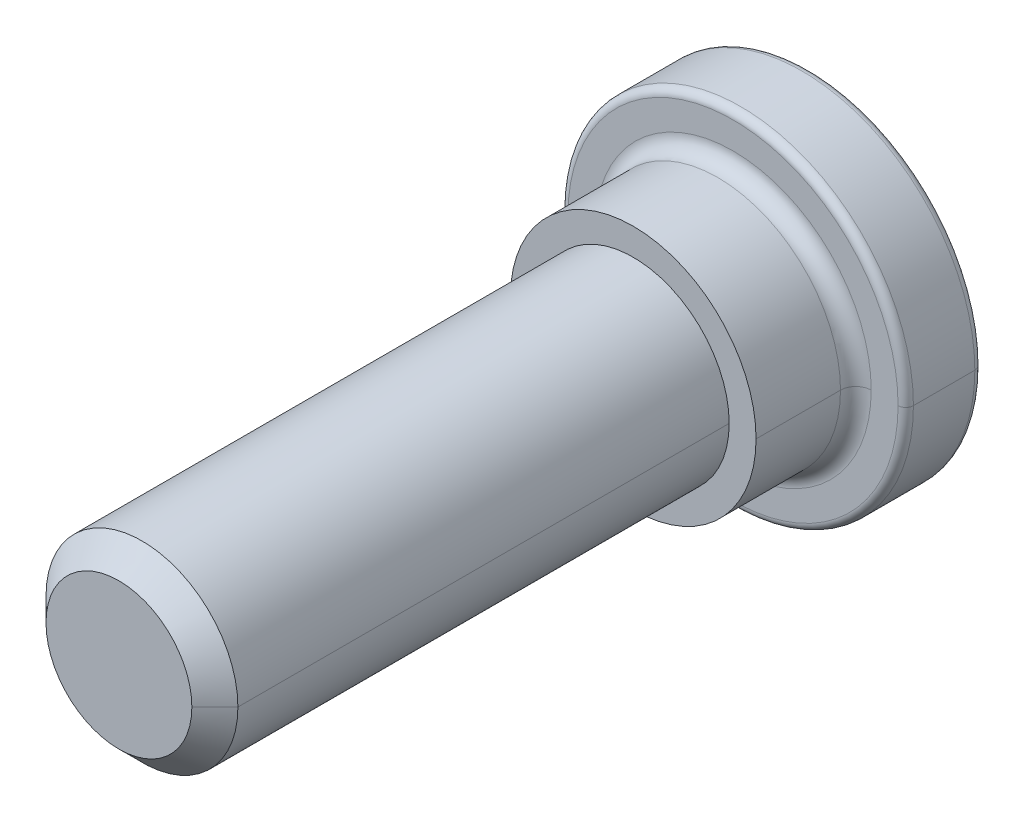
ISO-10303-21;
HEADER;
FILE_DESCRIPTION(('STEP AP214'),'2;1');
FILE_NAME('part.step','',(''),(''),'','','');
FILE_SCHEMA(('AUTOMOTIVE_DESIGN { 1 0 10303 214 1 1 1 1 }'));
ENDSEC;
DATA;
#1=APPLICATION_CONTEXT('core data for automotive mechanical design processes');
#2=APPLICATION_PROTOCOL_DEFINITION('international standard','automotive_design',2000,#1);
#3=PRODUCT_CONTEXT('',#1,'mechanical');
#4=PRODUCT('Part','Part','',(#3));
#5=PRODUCT_RELATED_PRODUCT_CATEGORY('part','',(#4));
#6=PRODUCT_DEFINITION_FORMATION('','',#4);
#7=PRODUCT_DEFINITION_CONTEXT('part definition',#1,'design');
#8=PRODUCT_DEFINITION('design','',#6,#7);
#9=PRODUCT_DEFINITION_SHAPE('','',#8);
#10=(LENGTH_UNIT() NAMED_UNIT(*) SI_UNIT(.MILLI.,.METRE.));
#11=(NAMED_UNIT(*) PLANE_ANGLE_UNIT() SI_UNIT($,.RADIAN.));
#12=(NAMED_UNIT(*) SI_UNIT($,.STERADIAN.) SOLID_ANGLE_UNIT());
#13=UNCERTAINTY_MEASURE_WITH_UNIT(LENGTH_MEASURE(1.E-05),#10,'distance_accuracy_value','');
#14=(GEOMETRIC_REPRESENTATION_CONTEXT(3) GLOBAL_UNCERTAINTY_ASSIGNED_CONTEXT((#13)) GLOBAL_UNIT_ASSIGNED_CONTEXT((#10,
#11,#12)) REPRESENTATION_CONTEXT('',''));
#15=CARTESIAN_POINT('',(0.,0.,0.));
#16=DIRECTION('',(0.,0.,1.));
#17=DIRECTION('',(1.,0.,0.));
#18=AXIS2_PLACEMENT_3D('',#15,#16,#17);
#19=CARTESIAN_POINT('',(0.,0.,1.2));
#20=DIRECTION('',(0.,0.,1.));
#21=DIRECTION('',(1.,0.,0.));
#22=AXIS2_PLACEMENT_3D('',#19,#20,#21);
#23=TOROIDAL_SURFACE('',#22,1.8,0.2);
#24=CARTESIAN_POINT('',(0.,0.,1.2));
#25=DIRECTION('',(0.,0.,1.));
#26=DIRECTION('',(1.,0.,0.));
#27=AXIS2_PLACEMENT_3D('',#24,#25,#26);
#28=CIRCLE('',#27,1.6);
#29=CARTESIAN_POINT('',(1.6,0.,1.2));
#30=VERTEX_POINT('',#29);
#31=CARTESIAN_POINT('',(-1.6,0.,1.2));
#32=VERTEX_POINT('',#31);
#33=EDGE_CURVE('E273',#30,#32,#28,.T.);
#34=ORIENTED_EDGE('',*,*,#33,.F.);
#35=CARTESIAN_POINT('',(1.8,0.,1.2));
#36=DIRECTION('',(0.,-1.,0.));
#37=DIRECTION('',(-1.,0.,0.));
#38=AXIS2_PLACEMENT_3D('',#35,#36,#37);
#39=CIRCLE('',#38,0.2);
#40=CARTESIAN_POINT('',(1.8,0.,1.));
#41=VERTEX_POINT('',#40);
#42=EDGE_CURVE('E212',#30,#41,#39,.T.);
#43=ORIENTED_EDGE('',*,*,#42,.T.);
#44=CARTESIAN_POINT('',(0.,0.,1.));
#45=DIRECTION('',(0.,0.,1.));
#46=DIRECTION('',(1.,0.,0.));
#47=AXIS2_PLACEMENT_3D('',#44,#45,#46);
#48=CIRCLE('',#47,1.8);
#49=CARTESIAN_POINT('',(-1.8,0.,1.));
#50=VERTEX_POINT('',#49);
#51=EDGE_CURVE('E197',#41,#50,#48,.T.);
#52=ORIENTED_EDGE('',*,*,#51,.T.);
#53=CARTESIAN_POINT('',(-1.8,0.,1.2));
#54=DIRECTION('',(0.,1.,0.));
#55=DIRECTION('',(1.,0.,0.));
#56=AXIS2_PLACEMENT_3D('',#53,#54,#55);
#57=CIRCLE('',#56,0.2);
#58=EDGE_CURVE('E186',#32,#50,#57,.T.);
#59=ORIENTED_EDGE('',*,*,#58,.F.);
#60=EDGE_LOOP('',(#34,#43,#52,#59));
#61=FACE_BOUND('',#60,.T.);
#62=ADVANCED_FACE('F16',(#61),#23,.F.);
#63=CARTESIAN_POINT('',(0.,0.,8.85));
#64=DIRECTION('',(0.,0.,-1.));
#65=DIRECTION('',(-1.,0.,0.));
#66=AXIS2_PLACEMENT_3D('',#63,#64,#65);
#67=CONICAL_SURFACE('',#66,1.1,0.7853981633973);
#68=CARTESIAN_POINT('',(0.,0.,9.));
#69=DIRECTION('',(0.,0.,-1.));
#70=DIRECTION('',(1.,0.,0.));
#71=AXIS2_PLACEMENT_3D('',#68,#69,#70);
#72=CIRCLE('',#71,0.95);
#73=CARTESIAN_POINT('',(0.95,0.,9.));
#74=VERTEX_POINT('',#73);
#75=CARTESIAN_POINT('',(-0.95,0.,9.));
#76=VERTEX_POINT('',#75);
#77=EDGE_CURVE('E11',#74,#76,#72,.T.);
#78=ORIENTED_EDGE('',*,*,#77,.T.);
#79=DIRECTION('',(-0.707106781186548,0.,-0.707106781186548));
#80=VECTOR('',#79,1.);
#81=CARTESIAN_POINT('',(-0.95,0.,9.));
#82=LINE('',#81,#80);
#83=CARTESIAN_POINT('',(-1.25,0.,8.7));
#84=VERTEX_POINT('',#83);
#85=EDGE_CURVE('E154',#76,#84,#82,.T.);
#86=ORIENTED_EDGE('',*,*,#85,.T.);
#87=CARTESIAN_POINT('',(0.,0.,8.7));
#88=DIRECTION('',(0.,0.,-1.));
#89=DIRECTION('',(1.,0.,0.));
#90=AXIS2_PLACEMENT_3D('',#87,#88,#89);
#91=CIRCLE('',#90,1.25);
#92=CARTESIAN_POINT('',(1.25,0.,8.7));
#93=VERTEX_POINT('',#92);
#94=EDGE_CURVE('E168',#93,#84,#91,.T.);
#95=ORIENTED_EDGE('',*,*,#94,.F.);
#96=DIRECTION('',(0.707106781186548,0.,-0.707106781186548));
#97=VECTOR('',#96,1.);
#98=CARTESIAN_POINT('',(0.95,0.,9.));
#99=LINE('',#98,#97);
#100=EDGE_CURVE('E146',#74,#93,#99,.T.);
#101=ORIENTED_EDGE('',*,*,#100,.F.);
#102=EDGE_LOOP('',(#78,#86,#95,#101));
#103=FACE_BOUND('',#102,.T.);
#104=ADVANCED_FACE('F18',(#103),#67,.T.);
#105=CARTESIAN_POINT('',(0.,0.,9.));
#106=DIRECTION('',(0.,0.,1.));
#107=DIRECTION('',(1.,0.,0.));
#108=AXIS2_PLACEMENT_3D('',#105,#106,#107);
#109=PLANE('',#108);
#110=CARTESIAN_POINT('',(0.,0.,9.));
#111=DIRECTION('',(0.,0.,-1.));
#112=DIRECTION('',(-1.,0.,0.));
#113=AXIS2_PLACEMENT_3D('',#110,#111,#112);
#114=CIRCLE('',#113,0.95);
#115=EDGE_CURVE('E27',#76,#74,#114,.T.);
#116=ORIENTED_EDGE('',*,*,#115,.F.);
#117=ORIENTED_EDGE('',*,*,#77,.F.);
#118=EDGE_LOOP('',(#116,#117));
#119=FACE_BOUND('',#118,.T.);
#120=ADVANCED_FACE('F408',(#119),#109,.T.);
#121=CARTESIAN_POINT('',(0.,0.,8.85));
#122=DIRECTION('',(0.,0.,-1.));
#123=DIRECTION('',(-1.,0.,0.));
#124=AXIS2_PLACEMENT_3D('',#121,#122,#123);
#125=CONICAL_SURFACE('',#124,1.1,0.7853981633973);
#126=ORIENTED_EDGE('',*,*,#100,.T.);
#127=CARTESIAN_POINT('',(0.,0.,8.7));
#128=DIRECTION('',(0.,0.,-1.));
#129=DIRECTION('',(-1.,0.,0.));
#130=AXIS2_PLACEMENT_3D('',#127,#128,#129);
#131=CIRCLE('',#130,1.25);
#132=EDGE_CURVE('E150',#84,#93,#131,.T.);
#133=ORIENTED_EDGE('',*,*,#132,.F.);
#134=ORIENTED_EDGE('',*,*,#85,.F.);
#135=ORIENTED_EDGE('',*,*,#115,.T.);
#136=EDGE_LOOP('',(#126,#133,#134,#135));
#137=FACE_BOUND('',#136,.T.);
#138=ADVANCED_FACE('F148',(#137),#125,.T.);
#139=CARTESIAN_POINT('',(0.,0.,9.));
#140=DIRECTION('',(0.,0.,-1.));
#141=DIRECTION('',(-1.,0.,0.));
#142=AXIS2_PLACEMENT_3D('',#139,#140,#141);
#143=CYLINDRICAL_SURFACE('',#142,1.25);
#144=DIRECTION('',(0.,0.,-1.));
#145=VECTOR('',#144,1.);
#146=CARTESIAN_POINT('',(1.25,0.,8.7));
#147=LINE('',#146,#145);
#148=CARTESIAN_POINT('',(1.25,0.,2.3));
#149=VERTEX_POINT('',#148);
#150=EDGE_CURVE('E160',#93,#149,#147,.T.);
#151=ORIENTED_EDGE('',*,*,#150,.T.);
#152=CARTESIAN_POINT('',(0.,0.,2.3));
#153=DIRECTION('',(0.,0.,1.));
#154=DIRECTION('',(1.,0.,0.));
#155=AXIS2_PLACEMENT_3D('',#152,#153,#154);
#156=CIRCLE('',#155,1.25);
#157=CARTESIAN_POINT('',(-1.25,0.,2.3));
#158=VERTEX_POINT('',#157);
#159=EDGE_CURVE('E182',#149,#158,#156,.T.);
#160=ORIENTED_EDGE('',*,*,#159,.T.);
#161=DIRECTION('',(0.,0.,-1.));
#162=VECTOR('',#161,1.);
#163=CARTESIAN_POINT('',(-1.25,0.,8.7));
#164=LINE('',#163,#162);
#165=EDGE_CURVE('E162',#84,#158,#164,.T.);
#166=ORIENTED_EDGE('',*,*,#165,.F.);
#167=ORIENTED_EDGE('',*,*,#132,.T.);
#168=EDGE_LOOP('',(#151,#160,#166,#167));
#169=FACE_BOUND('',#168,.T.);
#170=ADVANCED_FACE('F158',(#169),#143,.T.);
#171=CARTESIAN_POINT('',(0.,0.,9.));
#172=DIRECTION('',(0.,0.,-1.));
#173=DIRECTION('',(-1.,0.,0.));
#174=AXIS2_PLACEMENT_3D('',#171,#172,#173);
#175=CYLINDRICAL_SURFACE('',#174,1.25);
#176=ORIENTED_EDGE('',*,*,#94,.T.);
#177=ORIENTED_EDGE('',*,*,#165,.T.);
#178=CARTESIAN_POINT('',(0.,0.,2.3));
#179=DIRECTION('',(0.,0.,1.));
#180=DIRECTION('',(-1.,0.,0.));
#181=AXIS2_PLACEMENT_3D('',#178,#179,#180);
#182=CIRCLE('',#181,1.25);
#183=EDGE_CURVE('E170',#158,#149,#182,.T.);
#184=ORIENTED_EDGE('',*,*,#183,.T.);
#185=ORIENTED_EDGE('',*,*,#150,.F.);
#186=EDGE_LOOP('',(#176,#177,#184,#185));
#187=FACE_BOUND('',#186,.T.);
#188=ADVANCED_FACE('F167',(#187),#175,.T.);
#189=CARTESIAN_POINT('',(0.,0.,2.3));
#190=DIRECTION('',(0.,0.,1.));
#191=DIRECTION('',(1.,0.,0.));
#192=AXIS2_PLACEMENT_3D('',#189,#190,#191);
#193=PLANE('',#192);
#194=ORIENTED_EDGE('',*,*,#159,.F.);
#195=ORIENTED_EDGE('',*,*,#183,.F.);
#196=EDGE_LOOP('',(#194,#195));
#197=FACE_BOUND('',#196,.T.);
#198=CARTESIAN_POINT('',(0.,0.,2.3));
#199=DIRECTION('',(0.,0.,-1.));
#200=DIRECTION('',(-1.,0.,0.));
#201=AXIS2_PLACEMENT_3D('',#198,#199,#200);
#202=CIRCLE('',#201,1.6);
#203=CARTESIAN_POINT('',(-1.6,0.,2.3));
#204=VERTEX_POINT('',#203);
#205=CARTESIAN_POINT('',(1.6,0.,2.3));
#206=VERTEX_POINT('',#205);
#207=EDGE_CURVE('E275',#204,#206,#202,.T.);
#208=ORIENTED_EDGE('',*,*,#207,.F.);
#209=CARTESIAN_POINT('',(0.,0.,2.3));
#210=DIRECTION('',(0.,0.,-1.));
#211=DIRECTION('',(1.,0.,0.));
#212=AXIS2_PLACEMENT_3D('',#209,#210,#211);
#213=CIRCLE('',#212,1.6);
#214=EDGE_CURVE('E218',#206,#204,#213,.T.);
#215=ORIENTED_EDGE('',*,*,#214,.F.);
#216=EDGE_LOOP('',(#208,#215));
#217=FACE_BOUND('',#216,.T.);
#218=ADVANCED_FACE('F385',(#197,#217),#193,.T.);
#219=CARTESIAN_POINT('',(0.,0.,2.3));
#220=DIRECTION('',(0.,0.,-1.));
#221=DIRECTION('',(-1.,0.,0.));
#222=AXIS2_PLACEMENT_3D('',#219,#220,#221);
#223=CYLINDRICAL_SURFACE('',#222,1.6);
#224=DIRECTION('',(0.,0.,-1.));
#225=VECTOR('',#224,1.);
#226=CARTESIAN_POINT('',(1.6,0.,2.3));
#227=LINE('',#226,#225);
#228=EDGE_CURVE('E276',#206,#30,#227,.T.);
#229=ORIENTED_EDGE('',*,*,#228,.T.);
#230=ORIENTED_EDGE('',*,*,#33,.T.);
#231=DIRECTION('',(0.,0.,-1.));
#232=VECTOR('',#231,1.);
#233=CARTESIAN_POINT('',(-1.6,0.,2.3));
#234=LINE('',#233,#232);
#235=EDGE_CURVE('E286',#204,#32,#234,.T.);
#236=ORIENTED_EDGE('',*,*,#235,.F.);
#237=ORIENTED_EDGE('',*,*,#207,.T.);
#238=EDGE_LOOP('',(#229,#230,#236,#237));
#239=FACE_BOUND('',#238,.T.);
#240=ADVANCED_FACE('F377',(#239),#223,.T.);
#241=CARTESIAN_POINT('',(0.,0.,2.3));
#242=DIRECTION('',(0.,0.,-1.));
#243=DIRECTION('',(-1.,0.,0.));
#244=AXIS2_PLACEMENT_3D('',#241,#242,#243);
#245=CYLINDRICAL_SURFACE('',#244,1.6);
#246=ORIENTED_EDGE('',*,*,#214,.T.);
#247=ORIENTED_EDGE('',*,*,#235,.T.);
#248=CARTESIAN_POINT('',(0.,0.,1.2));
#249=DIRECTION('',(0.,0.,1.));
#250=DIRECTION('',(-1.,0.,0.));
#251=AXIS2_PLACEMENT_3D('',#248,#249,#250);
#252=CIRCLE('',#251,1.6);
#253=EDGE_CURVE('E215',#32,#30,#252,.T.);
#254=ORIENTED_EDGE('',*,*,#253,.T.);
#255=ORIENTED_EDGE('',*,*,#228,.F.);
#256=EDGE_LOOP('',(#246,#247,#254,#255));
#257=FACE_BOUND('',#256,.T.);
#258=ADVANCED_FACE('F382',(#257),#245,.T.);
#259=CARTESIAN_POINT('',(0.,0.,1.2));
#260=DIRECTION('',(0.,0.,1.));
#261=DIRECTION('',(1.,0.,0.));
#262=AXIS2_PLACEMENT_3D('',#259,#260,#261);
#263=TOROIDAL_SURFACE('',#262,1.8,0.2);
#264=ORIENTED_EDGE('',*,*,#58,.T.);
#265=CARTESIAN_POINT('',(0.,0.,1.));
#266=DIRECTION('',(0.,0.,1.));
#267=DIRECTION('',(-1.,0.,0.));
#268=AXIS2_PLACEMENT_3D('',#265,#266,#267);
#269=CIRCLE('',#268,1.8);
#270=EDGE_CURVE('E207',#50,#41,#269,.T.);
#271=ORIENTED_EDGE('',*,*,#270,.T.);
#272=ORIENTED_EDGE('',*,*,#42,.F.);
#273=ORIENTED_EDGE('',*,*,#253,.F.);
#274=EDGE_LOOP('',(#264,#271,#272,#273));
#275=FACE_BOUND('',#274,.T.);
#276=ADVANCED_FACE('F417',(#275),#263,.F.);
#277=CARTESIAN_POINT('',(0.,0.,1.));
#278=DIRECTION('',(0.,0.,1.));
#279=DIRECTION('',(1.,0.,0.));
#280=AXIS2_PLACEMENT_3D('',#277,#278,#279);
#281=PLANE('',#280);
#282=ORIENTED_EDGE('',*,*,#51,.F.);
#283=ORIENTED_EDGE('',*,*,#270,.F.);
#284=EDGE_LOOP('',(#282,#283));
#285=FACE_BOUND('',#284,.T.);
#286=CARTESIAN_POINT('',(0.,0.,1.));
#287=DIRECTION('',(0.,0.,-1.));
#288=DIRECTION('',(1.,0.,0.));
#289=AXIS2_PLACEMENT_3D('',#286,#287,#288);
#290=CIRCLE('',#289,2.15);
#291=CARTESIAN_POINT('',(2.15,0.,1.));
#292=VERTEX_POINT('',#291);
#293=CARTESIAN_POINT('',(-2.15,0.,1.));
#294=VERTEX_POINT('',#293);
#295=EDGE_CURVE('E193',#292,#294,#290,.T.);
#296=ORIENTED_EDGE('',*,*,#295,.F.);
#297=CARTESIAN_POINT('',(0.,0.,1.));
#298=DIRECTION('',(0.,0.,-1.));
#299=DIRECTION('',(-1.,0.,0.));
#300=AXIS2_PLACEMENT_3D('',#297,#298,#299);
#301=CIRCLE('',#300,2.15);
#302=EDGE_CURVE('E203',#294,#292,#301,.T.);
#303=ORIENTED_EDGE('',*,*,#302,.F.);
#304=EDGE_LOOP('',(#296,#303));
#305=FACE_BOUND('',#304,.T.);
#306=ADVANCED_FACE('F444',(#285,#305),#281,.T.);
#307=CARTESIAN_POINT('',(0.,0.,0.9));
#308=DIRECTION('',(0.,0.,1.));
#309=DIRECTION('',(1.,0.,0.));
#310=AXIS2_PLACEMENT_3D('',#307,#308,#309);
#311=TOROIDAL_SURFACE('',#310,2.15,0.1);
#312=CARTESIAN_POINT('',(0.,0.,0.9));
#313=DIRECTION('',(0.,0.,-1.));
#314=DIRECTION('',(1.,0.,0.));
#315=AXIS2_PLACEMENT_3D('',#312,#313,#314);
#316=CIRCLE('',#315,2.25);
#317=CARTESIAN_POINT('',(2.25,0.,0.9));
#318=VERTEX_POINT('',#317);
#319=CARTESIAN_POINT('',(-2.25,0.,0.9));
#320=VERTEX_POINT('',#319);
#321=EDGE_CURVE('E266',#318,#320,#316,.T.);
#322=ORIENTED_EDGE('',*,*,#321,.F.);
#323=CARTESIAN_POINT('',(2.15,0.,0.9));
#324=DIRECTION('',(0.,-1.,0.));
#325=DIRECTION('',(1.,0.,0.));
#326=AXIS2_PLACEMENT_3D('',#323,#324,#325);
#327=CIRCLE('',#326,0.1);
#328=EDGE_CURVE('E303',#318,#292,#327,.T.);
#329=ORIENTED_EDGE('',*,*,#328,.T.);
#330=ORIENTED_EDGE('',*,*,#295,.T.);
#331=CARTESIAN_POINT('',(-2.15,0.,0.9));
#332=DIRECTION('',(0.,1.,0.));
#333=DIRECTION('',(-1.,0.,0.));
#334=AXIS2_PLACEMENT_3D('',#331,#332,#333);
#335=CIRCLE('',#334,0.1);
#336=EDGE_CURVE('E199',#320,#294,#335,.T.);
#337=ORIENTED_EDGE('',*,*,#336,.F.);
#338=EDGE_LOOP('',(#322,#329,#330,#337));
#339=FACE_BOUND('',#338,.T.);
#340=ADVANCED_FACE('F441',(#339),#311,.T.);
#341=CARTESIAN_POINT('',(0.,0.,1.1));
#342=DIRECTION('',(0.,0.,-1.));
#343=DIRECTION('',(0.,-1.,0.));
#344=AXIS2_PLACEMENT_3D('',#341,#342,#343);
#345=PLANE('',#344);
#346=DIRECTION('',(0.866025403784429,-0.500000000000017,0.));
#347=VECTOR('',#346,1.);
#348=CARTESIAN_POINT('',(-1.,-0.5773502691895,1.1));
#349=LINE('',#348,#347);
#350=CARTESIAN_POINT('',(-1.,-0.5773502691895,1.1));
#351=VERTEX_POINT('',#350);
#352=CARTESIAN_POINT('',(1.088799896045E-13,-1.154700538379,1.1));
#353=VERTEX_POINT('',#352);
#354=EDGE_CURVE('E272',#351,#353,#349,.T.);
#355=ORIENTED_EDGE('',*,*,#354,.F.);
#356=DIRECTION('',(0.,1.,0.));
#357=VECTOR('',#356,1.);
#358=CARTESIAN_POINT('',(-1.,-0.5773502691895,1.1));
#359=LINE('',#358,#357);
#360=CARTESIAN_POINT('',(-1.,0.5773502691896,1.1));
#361=VERTEX_POINT('',#360);
#362=EDGE_CURVE('E198',#351,#361,#359,.T.);
#363=ORIENTED_EDGE('',*,*,#362,.T.);
#364=DIRECTION('',(-0.866025403784454,-0.499999999999973,0.));
#365=VECTOR('',#364,1.);
#366=CARTESIAN_POINT('',(-1.088799896045E-13,1.154700538379,1.1));
#367=LINE('',#366,#365);
#368=CARTESIAN_POINT('',(-1.088799896045E-13,1.154700538379,1.1));
#369=VERTEX_POINT('',#368);
#370=EDGE_CURVE('E332',#369,#361,#367,.T.);
#371=ORIENTED_EDGE('',*,*,#370,.F.);
#372=DIRECTION('',(-0.866025403784429,0.500000000000017,0.));
#373=VECTOR('',#372,1.);
#374=CARTESIAN_POINT('',(1.,0.5773502691895,1.1));
#375=LINE('',#374,#373);
#376=CARTESIAN_POINT('',(1.,0.5773502691895,1.1));
#377=VERTEX_POINT('',#376);
#378=EDGE_CURVE('E261',#377,#369,#375,.T.);
#379=ORIENTED_EDGE('',*,*,#378,.F.);
#380=DIRECTION('',(0.,-1.,0.));
#381=VECTOR('',#380,1.);
#382=CARTESIAN_POINT('',(1.,0.5773502691895,1.1));
#383=LINE('',#382,#381);
#384=CARTESIAN_POINT('',(1.,-0.5773502691896,1.1));
#385=VERTEX_POINT('',#384);
#386=EDGE_CURVE('E191',#377,#385,#383,.T.);
#387=ORIENTED_EDGE('',*,*,#386,.T.);
#388=DIRECTION('',(0.866025403784454,0.499999999999973,0.));
#389=VECTOR('',#388,1.);
#390=CARTESIAN_POINT('',(1.088799896045E-13,-1.154700538379,1.1));
#391=LINE('',#390,#389);
#392=EDGE_CURVE('E192',#353,#385,#391,.T.);
#393=ORIENTED_EDGE('',*,*,#392,.F.);
#394=EDGE_LOOP('',(#355,#363,#371,#379,#387,#393));
#395=FACE_BOUND('',#394,.T.);
#396=ADVANCED_FACE('F354',(#395),#345,.T.);
#397=CARTESIAN_POINT('',(-1.,-0.5773502691896,1.1));
#398=DIRECTION('',(-1.,0.,0.));
#399=DIRECTION('',(0.,0.,1.));
#400=AXIS2_PLACEMENT_3D('',#397,#398,#399);
#401=PLANE('',#400);
#402=DIRECTION('',(0.,0.,-1.));
#403=VECTOR('',#402,1.);
#404=CARTESIAN_POINT('',(-1.,0.5773502691896,1.1));
#405=LINE('',#404,#403);
#406=CARTESIAN_POINT('',(-1.,0.5773502691895,0.));
#407=VERTEX_POINT('',#406);
#408=EDGE_CURVE('E20',#361,#407,#405,.T.);
#409=ORIENTED_EDGE('',*,*,#408,.F.);
#410=ORIENTED_EDGE('',*,*,#362,.F.);
#411=DIRECTION('',(0.,0.,-1.));
#412=VECTOR('',#411,1.);
#413=CARTESIAN_POINT('',(-1.,-0.5773502691895,1.1));
#414=LINE('',#413,#412);
#415=CARTESIAN_POINT('',(-1.,-0.5773502691895,0.));
#416=VERTEX_POINT('',#415);
#417=EDGE_CURVE('E255',#351,#416,#414,.T.);
#418=ORIENTED_EDGE('',*,*,#417,.T.);
#419=DIRECTION('',(0.,1.,0.));
#420=VECTOR('',#419,1.);
#421=CARTESIAN_POINT('',(-1.,-0.5773502691895,0.));
#422=LINE('',#421,#420);
#423=EDGE_CURVE('E236',#416,#407,#422,.T.);
#424=ORIENTED_EDGE('',*,*,#423,.T.);
#425=EDGE_LOOP('',(#409,#410,#418,#424));
#426=FACE_BOUND('',#425,.T.);
#427=ADVANCED_FACE('F448',(#426),#401,.F.);
#428=CARTESIAN_POINT('',(-1.,0.5773502691896,1.1));
#429=DIRECTION('',(-0.500000000000017,0.866025403784429,0.));
#430=DIRECTION('',(0.,0.,1.));
#431=AXIS2_PLACEMENT_3D('',#428,#429,#430);
#432=PLANE('',#431);
#433=DIRECTION('',(1.319558121804E-13,0.,-1.));
#434=VECTOR('',#433,1.);
#435=CARTESIAN_POINT('',(-1.088799896045E-13,1.154700538379,1.1));
#436=LINE('',#435,#434);
#437=CARTESIAN_POINT('',(0.,1.154700538379,0.));
#438=VERTEX_POINT('',#437);
#439=EDGE_CURVE('E265',#369,#438,#436,.T.);
#440=ORIENTED_EDGE('',*,*,#439,.F.);
#441=ORIENTED_EDGE('',*,*,#370,.T.);
#442=ORIENTED_EDGE('',*,*,#408,.T.);
#443=DIRECTION('',(0.866025403784454,0.499999999999973,0.));
#444=VECTOR('',#443,1.);
#445=CARTESIAN_POINT('',(-1.,0.5773502691895,0.));
#446=LINE('',#445,#444);
#447=EDGE_CURVE('E232',#407,#438,#446,.T.);
#448=ORIENTED_EDGE('',*,*,#447,.T.);
#449=EDGE_LOOP('',(#440,#441,#442,#448));
#450=FACE_BOUND('',#449,.T.);
#451=ADVANCED_FACE('F450',(#450),#432,.F.);
#452=CARTESIAN_POINT('',(0.,1.154700538379,1.1));
#453=DIRECTION('',(0.500000000000017,0.866025403784429,0.));
#454=DIRECTION('',(0.,0.,-1.));
#455=AXIS2_PLACEMENT_3D('',#452,#453,#454);
#456=PLANE('',#455);
#457=DIRECTION('',(0.,0.,-1.));
#458=VECTOR('',#457,1.);
#459=CARTESIAN_POINT('',(1.,0.5773502691895,1.1));
#460=LINE('',#459,#458);
#461=CARTESIAN_POINT('',(1.,0.5773502691895,0.));
#462=VERTEX_POINT('',#461);
#463=EDGE_CURVE('E228',#377,#462,#460,.T.);
#464=ORIENTED_EDGE('',*,*,#463,.F.);
#465=ORIENTED_EDGE('',*,*,#378,.T.);
#466=ORIENTED_EDGE('',*,*,#439,.T.);
#467=DIRECTION('',(0.866025403784429,-0.500000000000017,0.));
#468=VECTOR('',#467,1.);
#469=CARTESIAN_POINT('',(0.,1.154700538379,0.));
#470=LINE('',#469,#468);
#471=EDGE_CURVE('E229',#438,#462,#470,.T.);
#472=ORIENTED_EDGE('',*,*,#471,.T.);
#473=EDGE_LOOP('',(#464,#465,#466,#472));
#474=FACE_BOUND('',#473,.T.);
#475=ADVANCED_FACE('F421',(#474),#456,.F.);
#476=CARTESIAN_POINT('',(1.,0.5773502691896,1.1));
#477=DIRECTION('',(1.,0.,0.));
#478=DIRECTION('',(0.,1.,0.));
#479=AXIS2_PLACEMENT_3D('',#476,#477,#478);
#480=PLANE('',#479);
#481=DIRECTION('',(0.,0.,-1.));
#482=VECTOR('',#481,1.);
#483=CARTESIAN_POINT('',(1.,-0.5773502691896,1.1));
#484=LINE('',#483,#482);
#485=CARTESIAN_POINT('',(1.,-0.5773502691895,0.));
#486=VERTEX_POINT('',#485);
#487=EDGE_CURVE('E188',#385,#486,#484,.T.);
#488=ORIENTED_EDGE('',*,*,#487,.F.);
#489=ORIENTED_EDGE('',*,*,#386,.F.);
#490=ORIENTED_EDGE('',*,*,#463,.T.);
#491=DIRECTION('',(0.,-1.,0.));
#492=VECTOR('',#491,1.);
#493=CARTESIAN_POINT('',(1.,0.5773502691895,0.));
#494=LINE('',#493,#492);
#495=EDGE_CURVE('E233',#462,#486,#494,.T.);
#496=ORIENTED_EDGE('',*,*,#495,.T.);
#497=EDGE_LOOP('',(#488,#489,#490,#496));
#498=FACE_BOUND('',#497,.T.);
#499=ADVANCED_FACE('F418',(#498),#480,.F.);
#500=CARTESIAN_POINT('',(1.,-0.5773502691896,1.1));
#501=DIRECTION('',(0.500000000000017,-0.866025403784429,0.));
#502=DIRECTION('',(0.,0.,-1.));
#503=AXIS2_PLACEMENT_3D('',#500,#501,#502);
#504=PLANE('',#503);
#505=DIRECTION('',(-1.319558121804E-13,0.,-1.));
#506=VECTOR('',#505,1.);
#507=CARTESIAN_POINT('',(1.088799896045E-13,-1.154700538379,1.1));
#508=LINE('',#507,#506);
#509=CARTESIAN_POINT('',(0.,-1.154700538379,0.));
#510=VERTEX_POINT('',#509);
#511=EDGE_CURVE('E211',#353,#510,#508,.T.);
#512=ORIENTED_EDGE('',*,*,#511,.F.);
#513=ORIENTED_EDGE('',*,*,#392,.T.);
#514=ORIENTED_EDGE('',*,*,#487,.T.);
#515=DIRECTION('',(-0.866025403784454,-0.499999999999973,0.));
#516=VECTOR('',#515,1.);
#517=CARTESIAN_POINT('',(1.,-0.5773502691895,0.));
#518=LINE('',#517,#516);
#519=EDGE_CURVE('E223',#486,#510,#518,.T.);
#520=ORIENTED_EDGE('',*,*,#519,.T.);
#521=EDGE_LOOP('',(#512,#513,#514,#520));
#522=FACE_BOUND('',#521,.T.);
#523=ADVANCED_FACE('F359',(#522),#504,.F.);
#524=CARTESIAN_POINT('',(0.,-1.154700538379,1.1));
#525=DIRECTION('',(-0.500000000000017,-0.866025403784429,0.));
#526=DIRECTION('',(-0.866025403784429,0.500000000000017,0.));
#527=AXIS2_PLACEMENT_3D('',#524,#525,#526);
#528=PLANE('',#527);
#529=ORIENTED_EDGE('',*,*,#417,.F.);
#530=ORIENTED_EDGE('',*,*,#354,.T.);
#531=ORIENTED_EDGE('',*,*,#511,.T.);
#532=DIRECTION('',(-0.866025403784429,0.500000000000017,0.));
#533=VECTOR('',#532,1.);
#534=CARTESIAN_POINT('',(0.,-1.154700538379,0.));
#535=LINE('',#534,#533);
#536=EDGE_CURVE('E245',#510,#416,#535,.T.);
#537=ORIENTED_EDGE('',*,*,#536,.T.);
#538=EDGE_LOOP('',(#529,#530,#531,#537));
#539=FACE_BOUND('',#538,.T.);
#540=ADVANCED_FACE('F350',(#539),#528,.F.);
#541=CARTESIAN_POINT('',(0.,0.,0.));
#542=DIRECTION('',(0.,0.,1.));
#543=DIRECTION('',(1.,0.,0.));
#544=AXIS2_PLACEMENT_3D('',#541,#542,#543);
#545=PLANE('',#544);
#546=ORIENTED_EDGE('',*,*,#519,.F.);
#547=ORIENTED_EDGE('',*,*,#495,.F.);
#548=ORIENTED_EDGE('',*,*,#471,.F.);
#549=ORIENTED_EDGE('',*,*,#447,.F.);
#550=ORIENTED_EDGE('',*,*,#423,.F.);
#551=ORIENTED_EDGE('',*,*,#536,.F.);
#552=EDGE_LOOP('',(#546,#547,#548,#549,#550,#551));
#553=FACE_BOUND('',#552,.T.);
#554=CARTESIAN_POINT('',(0.,0.,0.));
#555=DIRECTION('',(0.,0.,1.));
#556=DIRECTION('',(1.,0.,0.));
#557=AXIS2_PLACEMENT_3D('',#554,#555,#556);
#558=CIRCLE('',#557,2.15);
#559=CARTESIAN_POINT('',(2.15,0.,0.));
#560=VERTEX_POINT('',#559);
#561=CARTESIAN_POINT('',(-2.15,0.,0.));
#562=VERTEX_POINT('',#561);
#563=EDGE_CURVE('E220',#560,#562,#558,.T.);
#564=ORIENTED_EDGE('',*,*,#563,.F.);
#565=CARTESIAN_POINT('',(0.,0.,0.));
#566=DIRECTION('',(0.,0.,1.));
#567=DIRECTION('',(-1.,0.,0.));
#568=AXIS2_PLACEMENT_3D('',#565,#566,#567);
#569=CIRCLE('',#568,2.15);
#570=EDGE_CURVE('E307',#562,#560,#569,.T.);
#571=ORIENTED_EDGE('',*,*,#570,.F.);
#572=EDGE_LOOP('',(#564,#571));
#573=FACE_BOUND('',#572,.T.);
#574=ADVANCED_FACE('F363',(#553,#573),#545,.F.);
#575=CARTESIAN_POINT('',(0.,0.,0.1));
#576=DIRECTION('',(0.,0.,1.));
#577=DIRECTION('',(1.,0.,0.));
#578=AXIS2_PLACEMENT_3D('',#575,#576,#577);
#579=TOROIDAL_SURFACE('',#578,2.15,0.1);
#580=CARTESIAN_POINT('',(-2.15,0.,0.1));
#581=DIRECTION('',(0.,1.,0.));
#582=DIRECTION('',(0.,0.,-1.));
#583=AXIS2_PLACEMENT_3D('',#580,#581,#582);
#584=CIRCLE('',#583,0.1);
#585=CARTESIAN_POINT('',(-2.25,0.,0.1));
#586=VERTEX_POINT('',#585);
#587=EDGE_CURVE('E224',#562,#586,#584,.T.);
#588=ORIENTED_EDGE('',*,*,#587,.T.);
#589=CARTESIAN_POINT('',(0.,0.,0.1));
#590=DIRECTION('',(0.,0.,1.));
#591=DIRECTION('',(1.,0.,0.));
#592=AXIS2_PLACEMENT_3D('',#589,#590,#591);
#593=CIRCLE('',#592,2.25);
#594=CARTESIAN_POINT('',(2.25,0.,0.1));
#595=VERTEX_POINT('',#594);
#596=EDGE_CURVE('E300',#595,#586,#593,.T.);
#597=ORIENTED_EDGE('',*,*,#596,.F.);
#598=CARTESIAN_POINT('',(2.15,0.,0.1));
#599=DIRECTION('',(0.,-1.,0.));
#600=DIRECTION('',(0.,0.,-1.));
#601=AXIS2_PLACEMENT_3D('',#598,#599,#600);
#602=CIRCLE('',#601,0.1);
#603=EDGE_CURVE('E311',#560,#595,#602,.T.);
#604=ORIENTED_EDGE('',*,*,#603,.F.);
#605=ORIENTED_EDGE('',*,*,#563,.T.);
#606=EDGE_LOOP('',(#588,#597,#604,#605));
#607=FACE_BOUND('',#606,.T.);
#608=ADVANCED_FACE('F410',(#607),#579,.T.);
#609=CARTESIAN_POINT('',(0.,0.,0.1));
#610=DIRECTION('',(0.,0.,1.));
#611=DIRECTION('',(1.,0.,0.));
#612=AXIS2_PLACEMENT_3D('',#609,#610,#611);
#613=TOROIDAL_SURFACE('',#612,2.15,0.1);
#614=ORIENTED_EDGE('',*,*,#570,.T.);
#615=ORIENTED_EDGE('',*,*,#603,.T.);
#616=CARTESIAN_POINT('',(0.,0.,0.1));
#617=DIRECTION('',(0.,0.,1.));
#618=DIRECTION('',(-1.,0.,0.));
#619=AXIS2_PLACEMENT_3D('',#616,#617,#618);
#620=CIRCLE('',#619,2.25);
#621=EDGE_CURVE('E269',#586,#595,#620,.T.);
#622=ORIENTED_EDGE('',*,*,#621,.F.);
#623=ORIENTED_EDGE('',*,*,#587,.F.);
#624=EDGE_LOOP('',(#614,#615,#622,#623));
#625=FACE_BOUND('',#624,.T.);
#626=ADVANCED_FACE('F413',(#625),#613,.T.);
#627=CARTESIAN_POINT('',(0.,0.,1.));
#628=DIRECTION('',(0.,0.,-1.));
#629=DIRECTION('',(-1.,0.,0.));
#630=AXIS2_PLACEMENT_3D('',#627,#628,#629);
#631=CYLINDRICAL_SURFACE('',#630,2.25);
#632=ORIENTED_EDGE('',*,*,#321,.T.);
#633=DIRECTION('',(0.,0.,-1.));
#634=VECTOR('',#633,1.);
#635=CARTESIAN_POINT('',(-2.25,0.,0.9));
#636=LINE('',#635,#634);
#637=EDGE_CURVE('E270',#320,#586,#636,.T.);
#638=ORIENTED_EDGE('',*,*,#637,.T.);
#639=ORIENTED_EDGE('',*,*,#621,.T.);
#640=DIRECTION('',(0.,0.,-1.));
#641=VECTOR('',#640,1.);
#642=CARTESIAN_POINT('',(2.25,0.,0.9));
#643=LINE('',#642,#641);
#644=EDGE_CURVE('E323',#318,#595,#643,.T.);
#645=ORIENTED_EDGE('',*,*,#644,.F.);
#646=EDGE_LOOP('',(#632,#638,#639,#645));
#647=FACE_BOUND('',#646,.T.);
#648=ADVANCED_FACE('F425',(#647),#631,.T.);
#649=CARTESIAN_POINT('',(0.,0.,1.));
#650=DIRECTION('',(0.,0.,-1.));
#651=DIRECTION('',(-1.,0.,0.));
#652=AXIS2_PLACEMENT_3D('',#649,#650,#651);
#653=CYLINDRICAL_SURFACE('',#652,2.25);
#654=ORIENTED_EDGE('',*,*,#644,.T.);
#655=ORIENTED_EDGE('',*,*,#596,.T.);
#656=ORIENTED_EDGE('',*,*,#637,.F.);
#657=CARTESIAN_POINT('',(0.,0.,0.9));
#658=DIRECTION('',(0.,0.,-1.));
#659=DIRECTION('',(-1.,0.,0.));
#660=AXIS2_PLACEMENT_3D('',#657,#658,#659);
#661=CIRCLE('',#660,2.25);
#662=EDGE_CURVE('E294',#320,#318,#661,.T.);
#663=ORIENTED_EDGE('',*,*,#662,.T.);
#664=EDGE_LOOP('',(#654,#655,#656,#663));
#665=FACE_BOUND('',#664,.T.);
#666=ADVANCED_FACE('F431',(#665),#653,.T.);
#667=CARTESIAN_POINT('',(0.,0.,0.9));
#668=DIRECTION('',(0.,0.,1.));
#669=DIRECTION('',(1.,0.,0.));
#670=AXIS2_PLACEMENT_3D('',#667,#668,#669);
#671=TOROIDAL_SURFACE('',#670,2.15,0.1);
#672=ORIENTED_EDGE('',*,*,#336,.T.);
#673=ORIENTED_EDGE('',*,*,#302,.T.);
#674=ORIENTED_EDGE('',*,*,#328,.F.);
#675=ORIENTED_EDGE('',*,*,#662,.F.);
#676=EDGE_LOOP('',(#672,#673,#674,#675));
#677=FACE_BOUND('',#676,.T.);
#678=ADVANCED_FACE('F437',(#677),#671,.T.);
#679=CLOSED_SHELL('',(#62,#104,#120,#138,#170,#188,#218,#240,#258,#276,#306,#340,#396,#427,#451,
#475,#499,#523,#540,#574,#608,#626,#648,#666,#678));
#680=MANIFOLD_SOLID_BREP('B1',#679);
#681=ADVANCED_BREP_SHAPE_REPRESENTATION('',(#18,#680),#14);
#682=SHAPE_DEFINITION_REPRESENTATION(#9,#681);
ENDSEC;
END-ISO-10303-21;
